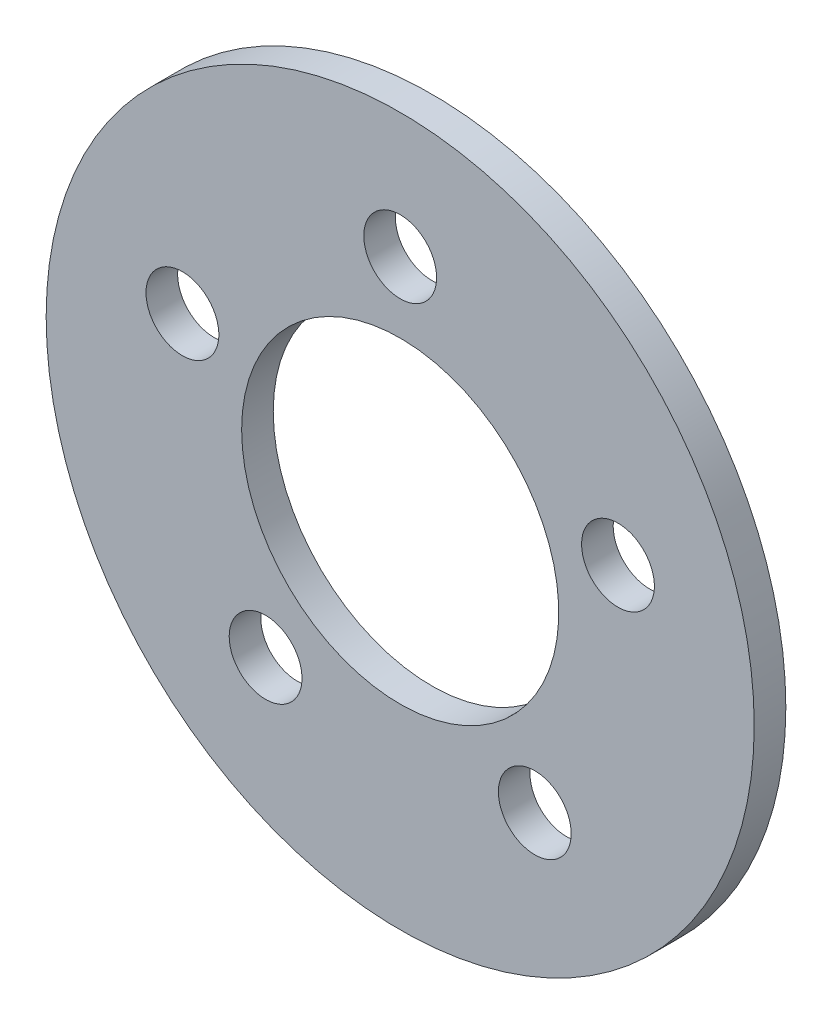
ISO-10303-21;
HEADER;
FILE_DESCRIPTION(('STEP AP214'),'2;1');
FILE_NAME('part.step','',(''),(''),'','','');
FILE_SCHEMA(('AUTOMOTIVE_DESIGN { 1 0 10303 214 1 1 1 1 }'));
ENDSEC;
DATA;
#1=APPLICATION_CONTEXT('core data for automotive mechanical design processes');
#2=APPLICATION_PROTOCOL_DEFINITION('international standard','automotive_design',2000,#1);
#3=PRODUCT_CONTEXT('',#1,'mechanical');
#4=PRODUCT('Part','Part','',(#3));
#5=PRODUCT_RELATED_PRODUCT_CATEGORY('part','',(#4));
#6=PRODUCT_DEFINITION_FORMATION('','',#4);
#7=PRODUCT_DEFINITION_CONTEXT('part definition',#1,'design');
#8=PRODUCT_DEFINITION('design','',#6,#7);
#9=PRODUCT_DEFINITION_SHAPE('','',#8);
#10=(LENGTH_UNIT() NAMED_UNIT(*) SI_UNIT(.MILLI.,.METRE.));
#11=(NAMED_UNIT(*) PLANE_ANGLE_UNIT() SI_UNIT($,.RADIAN.));
#12=(NAMED_UNIT(*) SI_UNIT($,.STERADIAN.) SOLID_ANGLE_UNIT());
#13=UNCERTAINTY_MEASURE_WITH_UNIT(LENGTH_MEASURE(1.E-05),#10,'distance_accuracy_value','');
#14=(GEOMETRIC_REPRESENTATION_CONTEXT(3) GLOBAL_UNCERTAINTY_ASSIGNED_CONTEXT((#13)) GLOBAL_UNIT_ASSIGNED_CONTEXT((#10,
#11,#12)) REPRESENTATION_CONTEXT('',''));
#15=CARTESIAN_POINT('',(0.,0.,0.));
#16=DIRECTION('',(0.,0.,1.));
#17=DIRECTION('',(1.,0.,0.));
#18=AXIS2_PLACEMENT_3D('',#15,#16,#17);
#19=CARTESIAN_POINT('',(0.,0.,-17.4625));
#20=DIRECTION('',(0.,0.,-1.));
#21=DIRECTION('',(-1.,0.,0.));
#22=AXIS2_PLACEMENT_3D('',#19,#20,#21);
#23=PLANE('',#22);
#24=CARTESIAN_POINT('',(0.,11.5,-17.4625));
#25=DIRECTION('',(0.,0.,-1.));
#26=DIRECTION('',(-1.,0.,0.));
#27=AXIS2_PLACEMENT_3D('',#24,#25,#26);
#28=CIRCLE('',#27,1.8288);
#29=CARTESIAN_POINT('',(-1.8288,11.5,-17.4625));
#30=VERTEX_POINT('',#29);
#31=EDGE_CURVE('E71',#30,#30,#28,.T.);
#32=ORIENTED_EDGE('',*,*,#31,.F.);
#33=EDGE_LOOP('',(#32));
#34=FACE_BOUND('',#33,.T.);
#35=CARTESIAN_POINT('',(-6.75953040136339,-9.30369543531193,-17.4625));
#36=DIRECTION('',(0.,0.,-1.));
#37=DIRECTION('',(-1.,0.,0.));
#38=AXIS2_PLACEMENT_3D('',#35,#36,#37);
#39=CIRCLE('',#38,1.8288);
#40=CARTESIAN_POINT('',(-8.58833040136339,-9.30369543531193,-17.4625));
#41=VERTEX_POINT('',#40);
#42=EDGE_CURVE('E59',#41,#41,#39,.T.);
#43=ORIENTED_EDGE('',*,*,#42,.F.);
#44=EDGE_LOOP('',(#43));
#45=FACE_BOUND('',#44,.T.);
#46=CARTESIAN_POINT('',(0.,0.,-17.4625));
#47=DIRECTION('',(0.,0.,-1.));
#48=DIRECTION('',(-1.,0.,0.));
#49=AXIS2_PLACEMENT_3D('',#46,#47,#48);
#50=CIRCLE('',#49,7.9629);
#51=CARTESIAN_POINT('',(-7.9629,0.,-17.4625));
#52=VERTEX_POINT('',#51);
#53=EDGE_CURVE('E48',#52,#52,#50,.T.);
#54=ORIENTED_EDGE('',*,*,#53,.F.);
#55=EDGE_LOOP('',(#54));
#56=FACE_BOUND('',#55,.T.);
#57=CARTESIAN_POINT('',(0.,0.,-17.4625));
#58=DIRECTION('',(0.,0.,-1.));
#59=DIRECTION('',(-1.,0.,0.));
#60=AXIS2_PLACEMENT_3D('',#57,#58,#59);
#61=CIRCLE('',#60,17.78);
#62=CARTESIAN_POINT('',(-17.78,0.,-17.4625));
#63=VERTEX_POINT('',#62);
#64=EDGE_CURVE('E10',#63,#63,#61,.T.);
#65=ORIENTED_EDGE('',*,*,#64,.T.);
#66=EDGE_LOOP('',(#65));
#67=FACE_BOUND('',#66,.T.);
#68=CARTESIAN_POINT('',(6.75953040136352,-9.30369543531184,-17.4625));
#69=DIRECTION('',(0.,0.,-1.));
#70=DIRECTION('',(-1.,0.,0.));
#71=AXIS2_PLACEMENT_3D('',#68,#69,#70);
#72=CIRCLE('',#71,1.8288);
#73=CARTESIAN_POINT('',(4.93073040136352,-9.30369543531184,-17.4625));
#74=VERTEX_POINT('',#73);
#75=EDGE_CURVE('E53',#74,#74,#72,.T.);
#76=ORIENTED_EDGE('',*,*,#75,.F.);
#77=EDGE_LOOP('',(#76));
#78=FACE_BOUND('',#77,.T.);
#79=CARTESIAN_POINT('',(-10.9371499373943,3.55369543531187,-17.4625));
#80=DIRECTION('',(0.,0.,-1.));
#81=DIRECTION('',(-1.,0.,0.));
#82=AXIS2_PLACEMENT_3D('',#79,#80,#81);
#83=CIRCLE('',#82,1.8288);
#84=CARTESIAN_POINT('',(-12.7659499373943,3.55369543531187,-17.4625));
#85=VERTEX_POINT('',#84);
#86=EDGE_CURVE('E65',#85,#85,#83,.T.);
#87=ORIENTED_EDGE('',*,*,#86,.F.);
#88=EDGE_LOOP('',(#87));
#89=FACE_BOUND('',#88,.T.);
#90=CARTESIAN_POINT('',(10.9371499373942,3.55369543531202,-17.4625));
#91=DIRECTION('',(0.,0.,-1.));
#92=DIRECTION('',(-1.,0.,0.));
#93=AXIS2_PLACEMENT_3D('',#90,#91,#92);
#94=CIRCLE('',#93,1.8288);
#95=CARTESIAN_POINT('',(9.10834993739423,3.55369543531202,-17.4625));
#96=VERTEX_POINT('',#95);
#97=EDGE_CURVE('E77',#96,#96,#94,.T.);
#98=ORIENTED_EDGE('',*,*,#97,.F.);
#99=EDGE_LOOP('',(#98));
#100=FACE_BOUND('',#99,.T.);
#101=ADVANCED_FACE('F37',(#34,#45,#56,#67,#78,#89,#100),#23,.T.);
#102=CARTESIAN_POINT('',(0.,0.,-15.875));
#103=DIRECTION('',(0.,0.,-1.));
#104=DIRECTION('',(-1.,0.,0.));
#105=AXIS2_PLACEMENT_3D('',#102,#103,#104);
#106=PLANE('',#105);
#107=CARTESIAN_POINT('',(0.,0.,-15.875));
#108=DIRECTION('',(0.,0.,-1.));
#109=DIRECTION('',(-1.,0.,0.));
#110=AXIS2_PLACEMENT_3D('',#107,#108,#109);
#111=CIRCLE('',#110,17.78);
#112=CARTESIAN_POINT('',(-17.78,0.,-15.875));
#113=VERTEX_POINT('',#112);
#114=EDGE_CURVE('E41',#113,#113,#111,.T.);
#115=ORIENTED_EDGE('',*,*,#114,.F.);
#116=EDGE_LOOP('',(#115));
#117=FACE_BOUND('',#116,.T.);
#118=CARTESIAN_POINT('',(0.,0.,-15.875));
#119=DIRECTION('',(0.,0.,-1.));
#120=DIRECTION('',(-1.,0.,0.));
#121=AXIS2_PLACEMENT_3D('',#118,#119,#120);
#122=CIRCLE('',#121,7.9629);
#123=CARTESIAN_POINT('',(-7.9629,0.,-15.875));
#124=VERTEX_POINT('',#123);
#125=EDGE_CURVE('E50',#124,#124,#122,.T.);
#126=ORIENTED_EDGE('',*,*,#125,.T.);
#127=EDGE_LOOP('',(#126));
#128=FACE_BOUND('',#127,.T.);
#129=CARTESIAN_POINT('',(6.75953040136352,-9.30369543531184,-15.875));
#130=DIRECTION('',(0.,0.,-1.));
#131=DIRECTION('',(-1.,0.,0.));
#132=AXIS2_PLACEMENT_3D('',#129,#130,#131);
#133=CIRCLE('',#132,1.8288);
#134=CARTESIAN_POINT('',(4.93073040136352,-9.30369543531184,-15.875));
#135=VERTEX_POINT('',#134);
#136=EDGE_CURVE('E56',#135,#135,#133,.T.);
#137=ORIENTED_EDGE('',*,*,#136,.T.);
#138=EDGE_LOOP('',(#137));
#139=FACE_BOUND('',#138,.T.);
#140=CARTESIAN_POINT('',(-6.75953040136339,-9.30369543531193,-15.875));
#141=DIRECTION('',(0.,0.,-1.));
#142=DIRECTION('',(-1.,0.,0.));
#143=AXIS2_PLACEMENT_3D('',#140,#141,#142);
#144=CIRCLE('',#143,1.8288);
#145=CARTESIAN_POINT('',(-8.58833040136339,-9.30369543531193,-15.875));
#146=VERTEX_POINT('',#145);
#147=EDGE_CURVE('E62',#146,#146,#144,.T.);
#148=ORIENTED_EDGE('',*,*,#147,.T.);
#149=EDGE_LOOP('',(#148));
#150=FACE_BOUND('',#149,.T.);
#151=CARTESIAN_POINT('',(-10.9371499373943,3.55369543531187,-15.875));
#152=DIRECTION('',(0.,0.,-1.));
#153=DIRECTION('',(-1.,0.,0.));
#154=AXIS2_PLACEMENT_3D('',#151,#152,#153);
#155=CIRCLE('',#154,1.8288);
#156=CARTESIAN_POINT('',(-12.7659499373943,3.55369543531187,-15.875));
#157=VERTEX_POINT('',#156);
#158=EDGE_CURVE('E68',#157,#157,#155,.T.);
#159=ORIENTED_EDGE('',*,*,#158,.T.);
#160=EDGE_LOOP('',(#159));
#161=FACE_BOUND('',#160,.T.);
#162=CARTESIAN_POINT('',(0.,11.5,-15.875));
#163=DIRECTION('',(0.,0.,-1.));
#164=DIRECTION('',(-1.,0.,0.));
#165=AXIS2_PLACEMENT_3D('',#162,#163,#164);
#166=CIRCLE('',#165,1.8288);
#167=CARTESIAN_POINT('',(-1.8288,11.5,-15.875));
#168=VERTEX_POINT('',#167);
#169=EDGE_CURVE('E74',#168,#168,#166,.T.);
#170=ORIENTED_EDGE('',*,*,#169,.T.);
#171=EDGE_LOOP('',(#170));
#172=FACE_BOUND('',#171,.T.);
#173=CARTESIAN_POINT('',(10.9371499373942,3.55369543531202,-15.875));
#174=DIRECTION('',(0.,0.,-1.));
#175=DIRECTION('',(-1.,0.,0.));
#176=AXIS2_PLACEMENT_3D('',#173,#174,#175);
#177=CIRCLE('',#176,1.8288);
#178=CARTESIAN_POINT('',(9.10834993739423,3.55369543531202,-15.875));
#179=VERTEX_POINT('',#178);
#180=EDGE_CURVE('E80',#179,#179,#177,.T.);
#181=ORIENTED_EDGE('',*,*,#180,.T.);
#182=EDGE_LOOP('',(#181));
#183=FACE_BOUND('',#182,.T.);
#184=ADVANCED_FACE('F90',(#117,#128,#139,#150,#161,#172,#183),#106,.F.);
#185=CARTESIAN_POINT('',(0.,0.,-17.4625));
#186=DIRECTION('',(0.,0.,1.));
#187=DIRECTION('',(1.,0.,0.));
#188=AXIS2_PLACEMENT_3D('',#185,#186,#187);
#189=CYLINDRICAL_SURFACE('',#188,17.78);
#190=ORIENTED_EDGE('',*,*,#64,.F.);
#191=EDGE_LOOP('',(#190));
#192=FACE_BOUND('',#191,.T.);
#193=ORIENTED_EDGE('',*,*,#114,.T.);
#194=EDGE_LOOP('',(#193));
#195=FACE_BOUND('',#194,.T.);
#196=ADVANCED_FACE('F39',(#192,#195),#189,.T.);
#197=CARTESIAN_POINT('',(0.,0.,-17.4625));
#198=DIRECTION('',(0.,0.,1.));
#199=DIRECTION('',(1.,0.,0.));
#200=AXIS2_PLACEMENT_3D('',#197,#198,#199);
#201=CYLINDRICAL_SURFACE('',#200,7.9629);
#202=ORIENTED_EDGE('',*,*,#53,.T.);
#203=EDGE_LOOP('',(#202));
#204=FACE_BOUND('',#203,.T.);
#205=ORIENTED_EDGE('',*,*,#125,.F.);
#206=EDGE_LOOP('',(#205));
#207=FACE_BOUND('',#206,.T.);
#208=ADVANCED_FACE('F100',(#204,#207),#201,.F.);
#209=CARTESIAN_POINT('',(6.75953040136352,-9.30369543531184,-17.4625));
#210=DIRECTION('',(0.,0.,1.));
#211=DIRECTION('',(1.,0.,0.));
#212=AXIS2_PLACEMENT_3D('',#209,#210,#211);
#213=CYLINDRICAL_SURFACE('',#212,1.8288);
#214=ORIENTED_EDGE('',*,*,#75,.T.);
#215=EDGE_LOOP('',(#214));
#216=FACE_BOUND('',#215,.T.);
#217=ORIENTED_EDGE('',*,*,#136,.F.);
#218=EDGE_LOOP('',(#217));
#219=FACE_BOUND('',#218,.T.);
#220=ADVANCED_FACE('F103',(#216,#219),#213,.F.);
#221=CARTESIAN_POINT('',(-6.75953040136339,-9.30369543531193,-17.4625));
#222=DIRECTION('',(0.,0.,1.));
#223=DIRECTION('',(1.,0.,0.));
#224=AXIS2_PLACEMENT_3D('',#221,#222,#223);
#225=CYLINDRICAL_SURFACE('',#224,1.8288);
#226=ORIENTED_EDGE('',*,*,#42,.T.);
#227=EDGE_LOOP('',(#226));
#228=FACE_BOUND('',#227,.T.);
#229=ORIENTED_EDGE('',*,*,#147,.F.);
#230=EDGE_LOOP('',(#229));
#231=FACE_BOUND('',#230,.T.);
#232=ADVANCED_FACE('F107',(#228,#231),#225,.F.);
#233=CARTESIAN_POINT('',(-10.9371499373943,3.55369543531187,-17.4625));
#234=DIRECTION('',(0.,0.,1.));
#235=DIRECTION('',(1.,0.,0.));
#236=AXIS2_PLACEMENT_3D('',#233,#234,#235);
#237=CYLINDRICAL_SURFACE('',#236,1.8288);
#238=ORIENTED_EDGE('',*,*,#86,.T.);
#239=EDGE_LOOP('',(#238));
#240=FACE_BOUND('',#239,.T.);
#241=ORIENTED_EDGE('',*,*,#158,.F.);
#242=EDGE_LOOP('',(#241));
#243=FACE_BOUND('',#242,.T.);
#244=ADVANCED_FACE('F111',(#240,#243),#237,.F.);
#245=CARTESIAN_POINT('',(0.,11.5,-17.4625));
#246=DIRECTION('',(0.,0.,1.));
#247=DIRECTION('',(1.,0.,0.));
#248=AXIS2_PLACEMENT_3D('',#245,#246,#247);
#249=CYLINDRICAL_SURFACE('',#248,1.8288);
#250=ORIENTED_EDGE('',*,*,#31,.T.);
#251=EDGE_LOOP('',(#250));
#252=FACE_BOUND('',#251,.T.);
#253=ORIENTED_EDGE('',*,*,#169,.F.);
#254=EDGE_LOOP('',(#253));
#255=FACE_BOUND('',#254,.T.);
#256=ADVANCED_FACE('F115',(#252,#255),#249,.F.);
#257=CARTESIAN_POINT('',(10.9371499373942,3.55369543531202,-17.4625));
#258=DIRECTION('',(0.,0.,1.));
#259=DIRECTION('',(1.,0.,0.));
#260=AXIS2_PLACEMENT_3D('',#257,#258,#259);
#261=CYLINDRICAL_SURFACE('',#260,1.8288);
#262=ORIENTED_EDGE('',*,*,#97,.T.);
#263=EDGE_LOOP('',(#262));
#264=FACE_BOUND('',#263,.T.);
#265=ORIENTED_EDGE('',*,*,#180,.F.);
#266=EDGE_LOOP('',(#265));
#267=FACE_BOUND('',#266,.T.);
#268=ADVANCED_FACE('F86',(#264,#267),#261,.F.);
#269=CLOSED_SHELL('',(#101,#184,#196,#208,#220,#232,#244,#256,#268));
#270=MANIFOLD_SOLID_BREP('B2',#269);
#271=ADVANCED_BREP_SHAPE_REPRESENTATION('',(#18,#270),#14);
#272=SHAPE_DEFINITION_REPRESENTATION(#9,#271);
ENDSEC;
END-ISO-10303-21;
